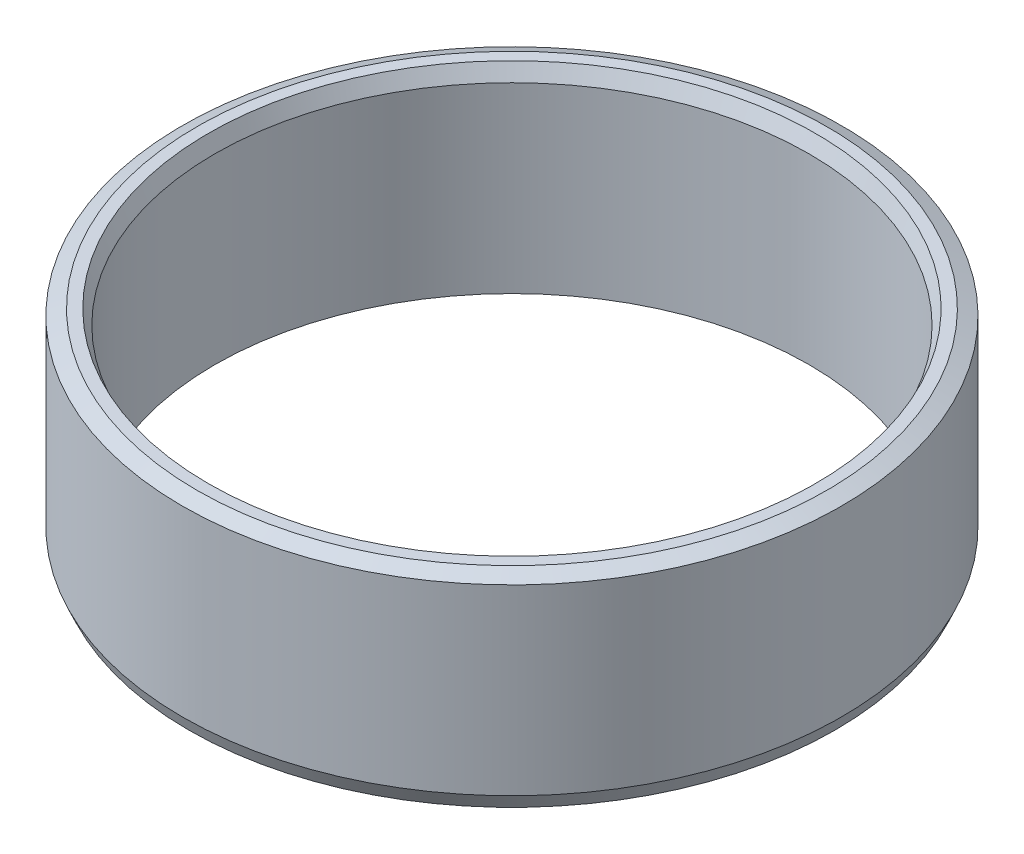
ISO-10303-21;
HEADER;
FILE_DESCRIPTION(('STEP AP214'),'2;1');
FILE_NAME('part.step','',(''),(''),'','','');
FILE_SCHEMA(('AUTOMOTIVE_DESIGN { 1 0 10303 214 1 1 1 1 }'));
ENDSEC;
DATA;
#1=APPLICATION_CONTEXT('core data for automotive mechanical design processes');
#2=APPLICATION_PROTOCOL_DEFINITION('international standard','automotive_design',2000,#1);
#3=PRODUCT_CONTEXT('',#1,'mechanical');
#4=PRODUCT('Part','Part','',(#3));
#5=PRODUCT_RELATED_PRODUCT_CATEGORY('part','',(#4));
#6=PRODUCT_DEFINITION_FORMATION('','',#4);
#7=PRODUCT_DEFINITION_CONTEXT('part definition',#1,'design');
#8=PRODUCT_DEFINITION('design','',#6,#7);
#9=PRODUCT_DEFINITION_SHAPE('','',#8);
#10=(LENGTH_UNIT() NAMED_UNIT(*) SI_UNIT(.MILLI.,.METRE.));
#11=(NAMED_UNIT(*) PLANE_ANGLE_UNIT() SI_UNIT($,.RADIAN.));
#12=(NAMED_UNIT(*) SI_UNIT($,.STERADIAN.) SOLID_ANGLE_UNIT());
#13=UNCERTAINTY_MEASURE_WITH_UNIT(LENGTH_MEASURE(1.E-05),#10,'distance_accuracy_value','');
#14=(GEOMETRIC_REPRESENTATION_CONTEXT(3) GLOBAL_UNCERTAINTY_ASSIGNED_CONTEXT((#13)) GLOBAL_UNIT_ASSIGNED_CONTEXT((#10,
#11,#12)) REPRESENTATION_CONTEXT('',''));
#15=CARTESIAN_POINT('',(0.,0.,0.));
#16=DIRECTION('',(0.,0.,1.));
#17=DIRECTION('',(1.,0.,0.));
#18=AXIS2_PLACEMENT_3D('',#15,#16,#17);
#19=CARTESIAN_POINT('',(0.,29.3380041313853,0.));
#20=DIRECTION('',(0.,-1.,0.));
#21=DIRECTION('',(0.,0.,-1.));
#22=AXIS2_PLACEMENT_3D('',#19,#20,#21);
#23=CYLINDRICAL_SURFACE('',#22,47.5);
#24=CARTESIAN_POINT('',(0.,2.1000806461493,0.));
#25=DIRECTION('',(0.,1.,0.));
#26=DIRECTION('',(0.,0.,1.));
#27=AXIS2_PLACEMENT_3D('',#24,#25,#26);
#28=CIRCLE('',#27,47.5);
#29=CARTESIAN_POINT('',(0.,2.1000806461493,47.5));
#30=VERTEX_POINT('',#29);
#31=EDGE_CURVE('E10',#30,#30,#28,.T.);
#32=ORIENTED_EDGE('',*,*,#31,.T.);
#33=EDGE_LOOP('',(#32));
#34=FACE_BOUND('',#33,.T.);
#35=CARTESIAN_POINT('',(0.,28.4200773945718,0.));
#36=DIRECTION('',(0.,1.,0.));
#37=DIRECTION('',(0.,0.,1.));
#38=AXIS2_PLACEMENT_3D('',#35,#36,#37);
#39=CIRCLE('',#38,47.5);
#40=CARTESIAN_POINT('',(0.,28.4200773945718,47.5));
#41=VERTEX_POINT('',#40);
#42=EDGE_CURVE('E50',#41,#41,#39,.F.);
#43=ORIENTED_EDGE('',*,*,#42,.T.);
#44=EDGE_LOOP('',(#43));
#45=FACE_BOUND('',#44,.T.);
#46=ADVANCED_FACE('F39',(#34,#45),#23,.T.);
#47=CARTESIAN_POINT('',(0.,29.3380041313853,0.));
#48=DIRECTION('',(0.,1.,0.));
#49=DIRECTION('',(0.,0.,1.));
#50=AXIS2_PLACEMENT_3D('',#47,#48,#49);
#51=PLANE('',#50);
#52=CARTESIAN_POINT('',(0.,29.3380041313853,0.));
#53=DIRECTION('',(0.,1.,0.));
#54=DIRECTION('',(0.,0.,1.));
#55=AXIS2_PLACEMENT_3D('',#52,#53,#54);
#56=CIRCLE('',#55,43.7392125818686);
#57=CARTESIAN_POINT('',(0.,29.3380041313853,43.7392125818686));
#58=VERTEX_POINT('',#57);
#59=EDGE_CURVE('E58',#58,#58,#56,.F.);
#60=ORIENTED_EDGE('',*,*,#59,.T.);
#61=EDGE_LOOP('',(#60));
#62=FACE_BOUND('',#61,.T.);
#63=CARTESIAN_POINT('',(0.,29.3380041313853,0.));
#64=DIRECTION('',(0.,1.,0.));
#65=DIRECTION('',(0.,0.,1.));
#66=AXIS2_PLACEMENT_3D('',#63,#64,#65);
#67=CIRCLE('',#66,45.3999193538507);
#68=CARTESIAN_POINT('',(0.,29.3380041313853,45.3999193538507));
#69=VERTEX_POINT('',#68);
#70=EDGE_CURVE('E61',#69,#69,#67,.T.);
#71=ORIENTED_EDGE('',*,*,#70,.T.);
#72=EDGE_LOOP('',(#71));
#73=FACE_BOUND('',#72,.T.);
#74=ADVANCED_FACE('F88',(#62,#73),#51,.T.);
#75=CARTESIAN_POINT('',(0.,0.,0.));
#76=DIRECTION('',(0.,1.,0.));
#77=DIRECTION('',(0.,0.,1.));
#78=AXIS2_PLACEMENT_3D('',#75,#76,#77);
#79=PLANE('',#78);
#80=CARTESIAN_POINT('',(0.,0.,0.));
#81=DIRECTION('',(0.,1.,0.));
#82=DIRECTION('',(0.,0.,1.));
#83=AXIS2_PLACEMENT_3D('',#80,#81,#82);
#84=CIRCLE('',#83,44.9213664912044);
#85=CARTESIAN_POINT('',(0.,0.,-44.9213664912044));
#86=VERTEX_POINT('',#85);
#87=EDGE_CURVE('E51',#86,#86,#84,.T.);
#88=ORIENTED_EDGE('',*,*,#87,.T.);
#89=EDGE_LOOP('',(#88));
#90=FACE_BOUND('',#89,.T.);
#91=CARTESIAN_POINT('',(0.,0.,0.));
#92=DIRECTION('',(0.,1.,0.));
#93=DIRECTION('',(0.,0.,1.));
#94=AXIS2_PLACEMENT_3D('',#91,#92,#93);
#95=CIRCLE('',#94,46.5820732631865);
#96=CARTESIAN_POINT('',(0.,0.,46.5820732631865));
#97=VERTEX_POINT('',#96);
#98=EDGE_CURVE('E54',#97,#97,#95,.F.);
#99=ORIENTED_EDGE('',*,*,#98,.T.);
#100=EDGE_LOOP('',(#99));
#101=FACE_BOUND('',#100,.T.);
#102=ADVANCED_FACE('F83',(#90,#101),#79,.F.);
#103=CARTESIAN_POINT('',(0.,29.3380041313853,0.));
#104=DIRECTION('',(0.,-1.,0.));
#105=DIRECTION('',(0.,0.,-1.));
#106=AXIS2_PLACEMENT_3D('',#103,#104,#105);
#107=CYLINDRICAL_SURFACE('',#106,42.8212858450551);
#108=CARTESIAN_POINT('',(0.,27.2379234852359,0.));
#109=DIRECTION('',(0.,1.,0.));
#110=DIRECTION('',(0.,0.,1.));
#111=AXIS2_PLACEMENT_3D('',#108,#109,#110);
#112=CIRCLE('',#111,42.8212858450551);
#113=CARTESIAN_POINT('',(0.,27.2379234852359,42.8212858450551));
#114=VERTEX_POINT('',#113);
#115=EDGE_CURVE('E67',#114,#114,#112,.T.);
#116=ORIENTED_EDGE('',*,*,#115,.T.);
#117=EDGE_LOOP('',(#116));
#118=FACE_BOUND('',#117,.T.);
#119=CARTESIAN_POINT('',(0.,0.917926736813519,0.));
#120=DIRECTION('',(0.,1.,0.));
#121=DIRECTION('',(0.,0.,1.));
#122=AXIS2_PLACEMENT_3D('',#119,#120,#121);
#123=CIRCLE('',#122,42.8212858450551);
#124=CARTESIAN_POINT('',(0.,0.917926736813519,-42.8212858450551));
#125=VERTEX_POINT('',#124);
#126=EDGE_CURVE('E69',#125,#125,#123,.F.);
#127=ORIENTED_EDGE('',*,*,#126,.T.);
#128=EDGE_LOOP('',(#127));
#129=FACE_BOUND('',#128,.T.);
#130=ADVANCED_FACE('F71',(#118,#129),#107,.F.);
#131=CARTESIAN_POINT('',(0.,27.2379234852359,0.));
#132=DIRECTION('',(0.,1.,0.));
#133=DIRECTION('',(0.,0.,1.));
#134=AXIS2_PLACEMENT_3D('',#131,#132,#133);
#135=CONICAL_SURFACE('',#134,42.8212858450551,0.412067253003427);
#136=ORIENTED_EDGE('',*,*,#59,.F.);
#137=EDGE_LOOP('',(#136));
#138=FACE_BOUND('',#137,.T.);
#139=ORIENTED_EDGE('',*,*,#115,.F.);
#140=EDGE_LOOP('',(#139));
#141=FACE_BOUND('',#140,.T.);
#142=ADVANCED_FACE('F77',(#138,#141),#135,.F.);
#143=CARTESIAN_POINT('',(0.,0.,0.));
#144=DIRECTION('',(0.,-1.,0.));
#145=DIRECTION('',(0.,0.,-1.));
#146=AXIS2_PLACEMENT_3D('',#143,#144,#145);
#147=CONICAL_SURFACE('',#146,44.9213664912044,1.15872907379147);
#148=CARTESIAN_POINT('',(0.,0.917926736813519,-42.8212858450551));
#149=CARTESIAN_POINT('',(0.,0.908364999971712,-42.8431616851191));
#150=CARTESIAN_POINT('',(0.,0.898803263129905,-42.8650375251832));
#151=CARTESIAN_POINT('',(0.,0.879679789446289,-42.9087892053113));
#152=CARTESIAN_POINT('',(0.,0.870118052604481,-42.9306650453754));
#153=CARTESIAN_POINT('',(0.,0.850994578920866,-42.9744167255035));
#154=CARTESIAN_POINT('',(0.,0.84143284207906,-42.9962925655675));
#155=CARTESIAN_POINT('',(0.,0.822309368395445,-43.0400442456956));
#156=CARTESIAN_POINT('',(0.,0.812747631553637,-43.0619200857597));
#157=CARTESIAN_POINT('',(0.,0.793624157870022,-43.1056717658878));
#158=CARTESIAN_POINT('',(0.,0.784062421028214,-43.1275476059519));
#159=CARTESIAN_POINT('',(0.,0.764938947344599,-43.17129928608));
#160=CARTESIAN_POINT('',(0.,0.755377210502792,-43.193175126144));
#161=CARTESIAN_POINT('',(0.,0.736253736819177,-43.2369268062721));
#162=CARTESIAN_POINT('',(0.,0.726691999977369,-43.2588026463362));
#163=CARTESIAN_POINT('',(0.,0.707568526293754,-43.3025543264643));
#164=CARTESIAN_POINT('',(0.,0.698006789451947,-43.3244301665284));
#165=CARTESIAN_POINT('',(0.,0.678883315768332,-43.3681818466565));
#166=CARTESIAN_POINT('',(0.,0.669321578926525,-43.3900576867205));
#167=CARTESIAN_POINT('',(0.,0.650198105242909,-43.4338093668486));
#168=CARTESIAN_POINT('',(0.,0.640636368401102,-43.4556852069127));
#169=CARTESIAN_POINT('',(0.,0.621512894717487,-43.4994368870408));
#170=CARTESIAN_POINT('',(0.,0.611951157875679,-43.5213127271049));
#171=CARTESIAN_POINT('',(0.,0.592827684192065,-43.565064407233));
#172=CARTESIAN_POINT('',(0.,0.583265947350257,-43.586940247297));
#173=CARTESIAN_POINT('',(0.,0.564142473666642,-43.6306919274251));
#174=CARTESIAN_POINT('',(0.,0.554580736824834,-43.6525677674892));
#175=CARTESIAN_POINT('',(0.,0.535457263141219,-43.6963194476173));
#176=CARTESIAN_POINT('',(0.,0.525895526299412,-43.7181952876814));
#177=CARTESIAN_POINT('',(0.,0.506772052615798,-43.7619469678095));
#178=CARTESIAN_POINT('',(0.,0.49721031577399,-43.7838228078735));
#179=CARTESIAN_POINT('',(0.,0.478086842090374,-43.8275744880016));
#180=CARTESIAN_POINT('',(0.,0.468525105248567,-43.8494503280657));
#181=CARTESIAN_POINT('',(0.,0.449401631564952,-43.8932020081938));
#182=CARTESIAN_POINT('',(0.,0.439839894723145,-43.9150778482579));
#183=CARTESIAN_POINT('',(0.,0.420716421039529,-43.958829528386));
#184=CARTESIAN_POINT('',(0.,0.411154684197722,-43.98070536845));
#185=CARTESIAN_POINT('',(0.,0.392031210514107,-44.0244570485781));
#186=CARTESIAN_POINT('',(0.,0.3824694736723,-44.0463328886422));
#187=CARTESIAN_POINT('',(0.,0.363345999988685,-44.0900845687703));
#188=CARTESIAN_POINT('',(0.,0.353784263146877,-44.1119604088344));
#189=CARTESIAN_POINT('',(0.,0.334660789463262,-44.1557120889625));
#190=CARTESIAN_POINT('',(0.,0.325099052621455,-44.1775879290265));
#191=CARTESIAN_POINT('',(0.,0.30597557893784,-44.2213396091546));
#192=CARTESIAN_POINT('',(0.,0.296413842096032,-44.2432154492187));
#193=CARTESIAN_POINT('',(0.,0.277290368412417,-44.2869671293468));
#194=CARTESIAN_POINT('',(0.,0.26772863157061,-44.3088429694109));
#195=CARTESIAN_POINT('',(0.,0.248605157886995,-44.352594649539));
#196=CARTESIAN_POINT('',(0.,0.239043421045187,-44.374470489603));
#197=CARTESIAN_POINT('',(0.,0.219919947361572,-44.4182221697311));
#198=CARTESIAN_POINT('',(0.,0.210358210519765,-44.4400980097952));
#199=CARTESIAN_POINT('',(0.,0.19123473683615,-44.4838496899233));
#200=CARTESIAN_POINT('',(0.,0.181672999994342,-44.5057255299874));
#201=CARTESIAN_POINT('',(0.,0.162549526310727,-44.5494772101155));
#202=CARTESIAN_POINT('',(0.,0.15298778946892,-44.5713530501795));
#203=CARTESIAN_POINT('',(0.,0.133864315785305,-44.6151047303076));
#204=CARTESIAN_POINT('',(0.,0.124302578943498,-44.6369805703717));
#205=CARTESIAN_POINT('',(0.,0.105179105259882,-44.6807322504998));
#206=CARTESIAN_POINT('',(0.,0.0956173684180744,-44.7026080905639));
#207=CARTESIAN_POINT('',(0.,0.0764938947344596,-44.746359770692));
#208=CARTESIAN_POINT('',(0.,0.0669321578926527,-44.768235610756));
#209=CARTESIAN_POINT('',(0.,0.047808684209038,-44.8119872908842));
#210=CARTESIAN_POINT('',(0.,0.0382469473672303,-44.8338631309482));
#211=CARTESIAN_POINT('',(0.,0.0191234736836147,-44.8776148110763));
#212=CARTESIAN_POINT('',(0.,0.00956173684180692,-44.8994906511404));
#213=CARTESIAN_POINT('',(0.,0.,-44.9213664912044));
#214=B_SPLINE_CURVE_WITH_KNOTS('',3,(#148,#149,#150,#151,#152,#153,#154,#155,#156,#157,#158,
#159,#160,#161,#162,#163,#164,#165,#166,#167,#168,#169,#170,#171,#172,#173,#174,#175,#176,#177,
#178,#179,#180,#181,#182,#183,#184,#185,#186,#187,#188,#189,#190,#191,#192,#193,#194,#195,#196,
#197,#198,#199,#200,#201,#202,#203,#204,#205,#206,#207,#208,#209,#210,#211,#212,#213),
.UNSPECIFIED.,.F.,.F.,(4,2,2,2,2,2,2,2,2,2,2,2,2,2,2,2,2,2,2,2,2,2,2,2,2,2,2,2,2,2,2,2,4),(0.,
0.0716227108497084,0.143245421699417,0.214868132549132,0.28649084339884,0.358113554248548,
0.429736265098257,0.501358975947965,0.57298168679768,0.644604397647388,0.716227108497097,
0.787849819346805,0.859472530196513,0.931095241046222,1.00271795189594,1.07434066274565,
1.14596337359535,1.21758608444506,1.28920879529477,1.36083150614449,1.43245421699419,
1.5040769278439,1.57569963869361,1.64732234954332,1.71894506039303,1.79056777124274,
1.86219048209245,1.93381319294216,2.00543590379187,2.07705861464158,2.14868132549129,
2.220304036341,2.29192674719071),.UNSPECIFIED.);
#215=EDGE_CURVE('BSEAM73',#125,#86,#214,.T.);
#216=ORIENTED_EDGE('',*,*,#126,.F.);
#217=ORIENTED_EDGE('',*,*,#87,.F.);
#218=ORIENTED_EDGE('',*,*,#215,.T.);
#219=ORIENTED_EDGE('',*,*,#215,.F.);
#220=EDGE_LOOP('',(#216,#218,#217,#219));
#221=FACE_BOUND('',#220,.T.);
#222=ADVANCED_FACE('F73',(#221),#147,.F.);
#223=CARTESIAN_POINT('',(0.,2.1000806461493,0.));
#224=DIRECTION('',(0.,1.,0.));
#225=DIRECTION('',(0.,0.,1.));
#226=AXIS2_PLACEMENT_3D('',#223,#224,#225);
#227=CONICAL_SURFACE('',#226,47.5,0.41206725300343);
#228=ORIENTED_EDGE('',*,*,#98,.F.);
#229=EDGE_LOOP('',(#228));
#230=FACE_BOUND('',#229,.T.);
#231=ORIENTED_EDGE('',*,*,#31,.F.);
#232=EDGE_LOOP('',(#231));
#233=FACE_BOUND('',#232,.T.);
#234=ADVANCED_FACE('F76',(#230,#233),#227,.T.);
#235=CARTESIAN_POINT('',(0.,29.3380041313853,0.));
#236=DIRECTION('',(0.,-1.,0.));
#237=DIRECTION('',(0.,0.,-1.));
#238=AXIS2_PLACEMENT_3D('',#235,#236,#237);
#239=CONICAL_SURFACE('',#238,45.3999193538507,1.15872907379147);
#240=ORIENTED_EDGE('',*,*,#42,.F.);
#241=EDGE_LOOP('',(#240));
#242=FACE_BOUND('',#241,.T.);
#243=ORIENTED_EDGE('',*,*,#70,.F.);
#244=EDGE_LOOP('',(#243));
#245=FACE_BOUND('',#244,.T.);
#246=ADVANCED_FACE('F45',(#242,#245),#239,.T.);
#247=CLOSED_SHELL('',(#46,#74,#102,#130,#142,#222,#234,#246));
#248=MANIFOLD_SOLID_BREP('B2',#247);
#249=ADVANCED_BREP_SHAPE_REPRESENTATION('',(#18,#248),#14);
#250=SHAPE_DEFINITION_REPRESENTATION(#9,#249);
ENDSEC;
END-ISO-10303-21;
